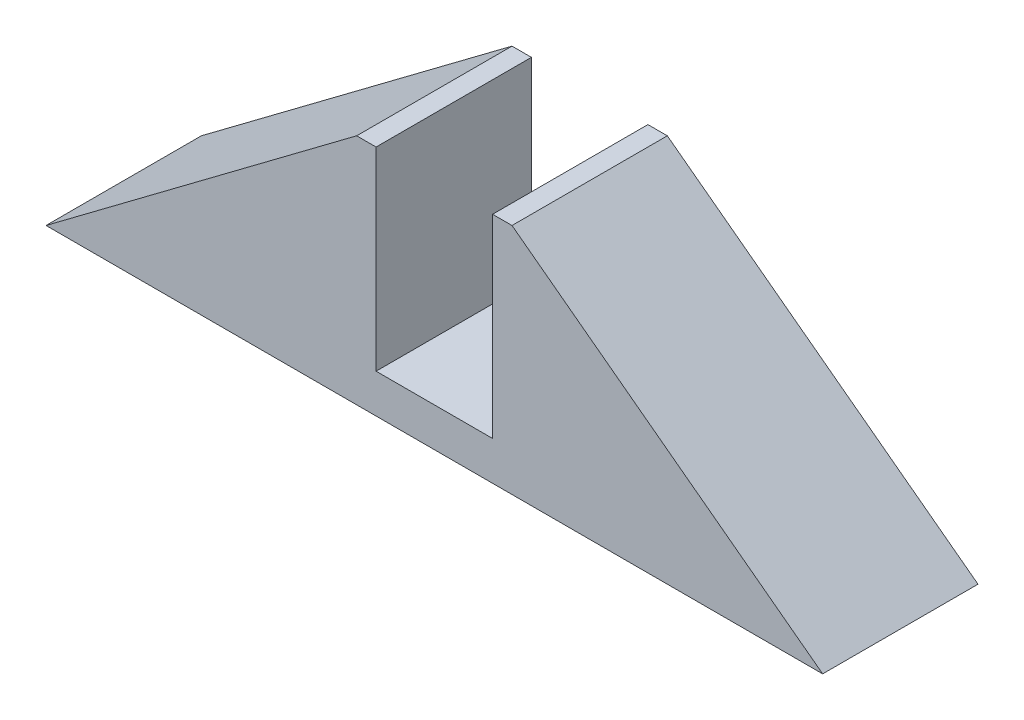
ISO-10303-21;
HEADER;
FILE_DESCRIPTION(('STEP AP214'),'2;1');
FILE_NAME('part.step','',(''),(''),'','','');
FILE_SCHEMA(('AUTOMOTIVE_DESIGN { 1 0 10303 214 1 1 1 1 }'));
ENDSEC;
DATA;
#1=APPLICATION_CONTEXT('core data for automotive mechanical design processes');
#2=APPLICATION_PROTOCOL_DEFINITION('international standard','automotive_design',2000,#1);
#3=PRODUCT_CONTEXT('',#1,'mechanical');
#4=PRODUCT('Part','Part','',(#3));
#5=PRODUCT_RELATED_PRODUCT_CATEGORY('part','',(#4));
#6=PRODUCT_DEFINITION_FORMATION('','',#4);
#7=PRODUCT_DEFINITION_CONTEXT('part definition',#1,'design');
#8=PRODUCT_DEFINITION('design','',#6,#7);
#9=PRODUCT_DEFINITION_SHAPE('','',#8);
#10=(LENGTH_UNIT() NAMED_UNIT(*) SI_UNIT(.MILLI.,.METRE.));
#11=(NAMED_UNIT(*) PLANE_ANGLE_UNIT() SI_UNIT($,.RADIAN.));
#12=(NAMED_UNIT(*) SI_UNIT($,.STERADIAN.) SOLID_ANGLE_UNIT());
#13=UNCERTAINTY_MEASURE_WITH_UNIT(LENGTH_MEASURE(1.E-05),#10,'distance_accuracy_value','');
#14=(GEOMETRIC_REPRESENTATION_CONTEXT(3) GLOBAL_UNCERTAINTY_ASSIGNED_CONTEXT((#13)) GLOBAL_UNIT_ASSIGNED_CONTEXT((#10,
#11,#12)) REPRESENTATION_CONTEXT('',''));
#15=CARTESIAN_POINT('',(0.,0.,0.));
#16=DIRECTION('',(0.,0.,1.));
#17=DIRECTION('',(1.,0.,0.));
#18=AXIS2_PLACEMENT_3D('',#15,#16,#17);
#19=CARTESIAN_POINT('',(-9.99999999999999,15.,10.));
#20=DIRECTION('',(0.,-1.,0.));
#21=DIRECTION('',(0.,0.,-1.));
#22=AXIS2_PLACEMENT_3D('',#19,#20,#21);
#23=PLANE('',#22);
#24=DIRECTION('',(-1.,0.,0.));
#25=VECTOR('',#24,1.);
#26=CARTESIAN_POINT('',(-9.99999999999999,15.,10.));
#27=LINE('',#26,#25);
#28=CARTESIAN_POINT('',(-7.5,15.,10.));
#29=VERTEX_POINT('',#28);
#30=CARTESIAN_POINT('',(-9.99999999999999,15.,10.));
#31=VERTEX_POINT('',#30);
#32=EDGE_CURVE('E163',#29,#31,#27,.T.);
#33=ORIENTED_EDGE('',*,*,#32,.F.);
#34=DIRECTION('',(0.,0.,1.));
#35=VECTOR('',#34,1.);
#36=CARTESIAN_POINT('',(-7.5,15.,-10.));
#37=LINE('',#36,#35);
#38=CARTESIAN_POINT('',(-7.5,15.,-10.));
#39=VERTEX_POINT('',#38);
#40=EDGE_CURVE('E149',#39,#29,#37,.T.);
#41=ORIENTED_EDGE('',*,*,#40,.F.);
#42=DIRECTION('',(-1.,0.,0.));
#43=VECTOR('',#42,1.);
#44=CARTESIAN_POINT('',(-9.99999999999999,15.,-10.));
#45=LINE('',#44,#43);
#46=CARTESIAN_POINT('',(-9.99999999999999,15.,-10.));
#47=VERTEX_POINT('',#46);
#48=EDGE_CURVE('E135',#39,#47,#45,.T.);
#49=ORIENTED_EDGE('',*,*,#48,.T.);
#50=DIRECTION('',(0.,0.,-1.));
#51=VECTOR('',#50,1.);
#52=CARTESIAN_POINT('',(-9.99999999999999,15.,10.));
#53=LINE('',#52,#51);
#54=EDGE_CURVE('E185',#31,#47,#53,.T.);
#55=ORIENTED_EDGE('',*,*,#54,.F.);
#56=EDGE_LOOP('',(#33,#41,#49,#55));
#57=FACE_BOUND('',#56,.T.);
#58=ADVANCED_FACE('F39',(#57),#23,.F.);
#59=CARTESIAN_POINT('',(9.99999999999999,15.,10.));
#60=DIRECTION('',(-0.6,-0.8,0.));
#61=DIRECTION('',(0.8,-0.6,0.));
#62=AXIS2_PLACEMENT_3D('',#59,#60,#61);
#63=PLANE('',#62);
#64=DIRECTION('',(-0.8,0.6,0.));
#65=VECTOR('',#64,1.);
#66=CARTESIAN_POINT('',(9.99999999999999,15.,-10.));
#67=LINE('',#66,#65);
#68=CARTESIAN_POINT('',(50.,-15.,-10.));
#69=VERTEX_POINT('',#68);
#70=CARTESIAN_POINT('',(9.99999999999999,15.,-10.));
#71=VERTEX_POINT('',#70);
#72=EDGE_CURVE('E152',#69,#71,#67,.T.);
#73=ORIENTED_EDGE('',*,*,#72,.T.);
#74=DIRECTION('',(0.,0.,-1.));
#75=VECTOR('',#74,1.);
#76=CARTESIAN_POINT('',(9.99999999999999,15.,10.));
#77=LINE('',#76,#75);
#78=CARTESIAN_POINT('',(9.99999999999999,15.,10.));
#79=VERTEX_POINT('',#78);
#80=EDGE_CURVE('E48',#79,#71,#77,.T.);
#81=ORIENTED_EDGE('',*,*,#80,.F.);
#82=DIRECTION('',(-0.8,0.6,0.));
#83=VECTOR('',#82,1.);
#84=CARTESIAN_POINT('',(9.99999999999999,15.,10.));
#85=LINE('',#84,#83);
#86=CARTESIAN_POINT('',(50.,-15.,10.));
#87=VERTEX_POINT('',#86);
#88=EDGE_CURVE('E93',#87,#79,#85,.T.);
#89=ORIENTED_EDGE('',*,*,#88,.F.);
#90=DIRECTION('',(0.,0.,-1.));
#91=VECTOR('',#90,1.);
#92=CARTESIAN_POINT('',(50.,-15.,10.));
#93=LINE('',#92,#91);
#94=EDGE_CURVE('E11',#87,#69,#93,.T.);
#95=ORIENTED_EDGE('',*,*,#94,.T.);
#96=EDGE_LOOP('',(#73,#81,#89,#95));
#97=FACE_BOUND('',#96,.T.);
#98=ADVANCED_FACE('F41',(#97),#63,.F.);
#99=CARTESIAN_POINT('',(7.5,15.,-10.));
#100=VERTEX_POINT('',#99);
#101=EDGE_CURVE('E174',#71,#100,#45,.T.);
#102=ORIENTED_EDGE('',*,*,#101,.T.);
#103=DIRECTION('',(0.,0.,1.));
#104=VECTOR('',#103,1.);
#105=CARTESIAN_POINT('',(7.5,15.,-10.));
#106=LINE('',#105,#104);
#107=CARTESIAN_POINT('',(7.5,15.,10.));
#108=VERTEX_POINT('',#107);
#109=EDGE_CURVE('E153',#100,#108,#106,.T.);
#110=ORIENTED_EDGE('',*,*,#109,.T.);
#111=EDGE_CURVE('E164',#79,#108,#27,.T.);
#112=ORIENTED_EDGE('',*,*,#111,.F.);
#113=ORIENTED_EDGE('',*,*,#80,.T.);
#114=EDGE_LOOP('',(#102,#110,#112,#113));
#115=FACE_BOUND('',#114,.T.);
#116=ADVANCED_FACE('F193',(#115),#23,.F.);
#117=CARTESIAN_POINT('',(-9.99999999999999,15.,10.));
#118=DIRECTION('',(0.6,-0.8,0.));
#119=DIRECTION('',(0.8,0.6,0.));
#120=AXIS2_PLACEMENT_3D('',#117,#118,#119);
#121=PLANE('',#120);
#122=DIRECTION('',(-0.8,-0.6,0.));
#123=VECTOR('',#122,1.);
#124=CARTESIAN_POINT('',(-9.99999999999999,15.,-10.));
#125=LINE('',#124,#123);
#126=CARTESIAN_POINT('',(-50.,-15.,-10.));
#127=VERTEX_POINT('',#126);
#128=EDGE_CURVE('E178',#47,#127,#125,.T.);
#129=ORIENTED_EDGE('',*,*,#128,.T.);
#130=DIRECTION('',(0.,0.,-1.));
#131=VECTOR('',#130,1.);
#132=CARTESIAN_POINT('',(-50.,-15.,10.));
#133=LINE('',#132,#131);
#134=CARTESIAN_POINT('',(-50.,-15.,10.));
#135=VERTEX_POINT('',#134);
#136=EDGE_CURVE('E171',#135,#127,#133,.T.);
#137=ORIENTED_EDGE('',*,*,#136,.F.);
#138=DIRECTION('',(-0.8,-0.6,0.));
#139=VECTOR('',#138,1.);
#140=CARTESIAN_POINT('',(-9.99999999999999,15.,10.));
#141=LINE('',#140,#139);
#142=EDGE_CURVE('E168',#31,#135,#141,.T.);
#143=ORIENTED_EDGE('',*,*,#142,.F.);
#144=ORIENTED_EDGE('',*,*,#54,.T.);
#145=EDGE_LOOP('',(#129,#137,#143,#144));
#146=FACE_BOUND('',#145,.T.);
#147=ADVANCED_FACE('F198',(#146),#121,.F.);
#148=CARTESIAN_POINT('',(-10.,-15.,10.));
#149=DIRECTION('',(0.,1.,0.));
#150=DIRECTION('',(0.,0.,1.));
#151=AXIS2_PLACEMENT_3D('',#148,#149,#150);
#152=PLANE('',#151);
#153=DIRECTION('',(1.,0.,0.));
#154=VECTOR('',#153,1.);
#155=CARTESIAN_POINT('',(-10.,-15.,-10.));
#156=LINE('',#155,#154);
#157=EDGE_CURVE('E86',#127,#69,#156,.T.);
#158=ORIENTED_EDGE('',*,*,#157,.T.);
#159=ORIENTED_EDGE('',*,*,#94,.F.);
#160=DIRECTION('',(1.,0.,0.));
#161=VECTOR('',#160,1.);
#162=CARTESIAN_POINT('',(50.,-15.,10.));
#163=LINE('',#162,#161);
#164=EDGE_CURVE('E64',#135,#87,#163,.T.);
#165=ORIENTED_EDGE('',*,*,#164,.F.);
#166=ORIENTED_EDGE('',*,*,#136,.T.);
#167=EDGE_LOOP('',(#158,#159,#165,#166));
#168=FACE_BOUND('',#167,.T.);
#169=ADVANCED_FACE('F194',(#168),#152,.F.);
#170=CARTESIAN_POINT('',(0.,0.,10.));
#171=DIRECTION('',(0.,0.,1.));
#172=DIRECTION('',(1.,0.,0.));
#173=AXIS2_PLACEMENT_3D('',#170,#171,#172);
#174=PLANE('',#173);
#175=DIRECTION('',(0.,-1.,0.));
#176=VECTOR('',#175,1.);
#177=CARTESIAN_POINT('',(-7.5,15.,10.));
#178=LINE('',#177,#176);
#179=CARTESIAN_POINT('',(-7.5,-10.,10.));
#180=VERTEX_POINT('',#179);
#181=EDGE_CURVE('E121',#29,#180,#178,.T.);
#182=ORIENTED_EDGE('',*,*,#181,.F.);
#183=ORIENTED_EDGE('',*,*,#32,.T.);
#184=ORIENTED_EDGE('',*,*,#142,.T.);
#185=ORIENTED_EDGE('',*,*,#164,.T.);
#186=ORIENTED_EDGE('',*,*,#88,.T.);
#187=ORIENTED_EDGE('',*,*,#111,.T.);
#188=DIRECTION('',(0.,1.,0.));
#189=VECTOR('',#188,1.);
#190=CARTESIAN_POINT('',(7.5,15.,10.));
#191=LINE('',#190,#189);
#192=CARTESIAN_POINT('',(7.5,-10.,10.));
#193=VERTEX_POINT('',#192);
#194=EDGE_CURVE('E137',#193,#108,#191,.T.);
#195=ORIENTED_EDGE('',*,*,#194,.F.);
#196=DIRECTION('',(1.,0.,0.));
#197=VECTOR('',#196,1.);
#198=CARTESIAN_POINT('',(-7.5,-10.,10.));
#199=LINE('',#198,#197);
#200=EDGE_CURVE('E140',#180,#193,#199,.T.);
#201=ORIENTED_EDGE('',*,*,#200,.F.);
#202=EDGE_LOOP('',(#182,#183,#184,#185,#186,#187,#195,#201));
#203=FACE_BOUND('',#202,.T.);
#204=ADVANCED_FACE('F205',(#203),#174,.T.);
#205=CARTESIAN_POINT('',(0.,0.,-10.));
#206=DIRECTION('',(0.,0.,1.));
#207=DIRECTION('',(1.,0.,0.));
#208=AXIS2_PLACEMENT_3D('',#205,#206,#207);
#209=PLANE('',#208);
#210=ORIENTED_EDGE('',*,*,#48,.F.);
#211=DIRECTION('',(0.,-1.,0.));
#212=VECTOR('',#211,1.);
#213=CARTESIAN_POINT('',(-7.5,15.,-10.));
#214=LINE('',#213,#212);
#215=CARTESIAN_POINT('',(-7.5,-10.,-10.));
#216=VERTEX_POINT('',#215);
#217=EDGE_CURVE('E118',#39,#216,#214,.T.);
#218=ORIENTED_EDGE('',*,*,#217,.T.);
#219=DIRECTION('',(1.,0.,0.));
#220=VECTOR('',#219,1.);
#221=CARTESIAN_POINT('',(-7.5,-10.,-10.));
#222=LINE('',#221,#220);
#223=CARTESIAN_POINT('',(7.5,-10.,-10.));
#224=VERTEX_POINT('',#223);
#225=EDGE_CURVE('E129',#216,#224,#222,.T.);
#226=ORIENTED_EDGE('',*,*,#225,.T.);
#227=DIRECTION('',(0.,1.,0.));
#228=VECTOR('',#227,1.);
#229=CARTESIAN_POINT('',(7.5,15.,-10.));
#230=LINE('',#229,#228);
#231=EDGE_CURVE('E55',#224,#100,#230,.T.);
#232=ORIENTED_EDGE('',*,*,#231,.T.);
#233=ORIENTED_EDGE('',*,*,#101,.F.);
#234=ORIENTED_EDGE('',*,*,#72,.F.);
#235=ORIENTED_EDGE('',*,*,#157,.F.);
#236=ORIENTED_EDGE('',*,*,#128,.F.);
#237=EDGE_LOOP('',(#210,#218,#226,#232,#233,#234,#235,#236));
#238=FACE_BOUND('',#237,.T.);
#239=ADVANCED_FACE('F134',(#238),#209,.F.);
#240=CARTESIAN_POINT('',(-7.5,15.,-10.));
#241=DIRECTION('',(-1.,0.,0.));
#242=DIRECTION('',(0.,-1.,0.));
#243=AXIS2_PLACEMENT_3D('',#240,#241,#242);
#244=PLANE('',#243);
#245=ORIENTED_EDGE('',*,*,#181,.T.);
#246=DIRECTION('',(0.,0.,1.));
#247=VECTOR('',#246,1.);
#248=CARTESIAN_POINT('',(-7.5,-10.,-10.));
#249=LINE('',#248,#247);
#250=EDGE_CURVE('E114',#216,#180,#249,.T.);
#251=ORIENTED_EDGE('',*,*,#250,.F.);
#252=ORIENTED_EDGE('',*,*,#217,.F.);
#253=ORIENTED_EDGE('',*,*,#40,.T.);
#254=EDGE_LOOP('',(#245,#251,#252,#253));
#255=FACE_BOUND('',#254,.T.);
#256=ADVANCED_FACE('F116',(#255),#244,.F.);
#257=CARTESIAN_POINT('',(7.5,15.,-10.));
#258=DIRECTION('',(1.,0.,0.));
#259=DIRECTION('',(0.,1.,0.));
#260=AXIS2_PLACEMENT_3D('',#257,#258,#259);
#261=PLANE('',#260);
#262=ORIENTED_EDGE('',*,*,#194,.T.);
#263=ORIENTED_EDGE('',*,*,#109,.F.);
#264=ORIENTED_EDGE('',*,*,#231,.F.);
#265=DIRECTION('',(0.,0.,1.));
#266=VECTOR('',#265,1.);
#267=CARTESIAN_POINT('',(7.5,-10.,-10.));
#268=LINE('',#267,#266);
#269=EDGE_CURVE('E126',#224,#193,#268,.T.);
#270=ORIENTED_EDGE('',*,*,#269,.T.);
#271=EDGE_LOOP('',(#262,#263,#264,#270));
#272=FACE_BOUND('',#271,.T.);
#273=ADVANCED_FACE('F207',(#272),#261,.F.);
#274=CARTESIAN_POINT('',(-7.5,-10.,-10.));
#275=DIRECTION('',(0.,-1.,0.));
#276=DIRECTION('',(1.,0.,0.));
#277=AXIS2_PLACEMENT_3D('',#274,#275,#276);
#278=PLANE('',#277);
#279=ORIENTED_EDGE('',*,*,#200,.T.);
#280=ORIENTED_EDGE('',*,*,#269,.F.);
#281=ORIENTED_EDGE('',*,*,#225,.F.);
#282=ORIENTED_EDGE('',*,*,#250,.T.);
#283=EDGE_LOOP('',(#279,#280,#281,#282));
#284=FACE_BOUND('',#283,.T.);
#285=ADVANCED_FACE('F130',(#284),#278,.F.);
#286=CLOSED_SHELL('',(#58,#98,#116,#147,#169,#204,#239,#256,#273,#285));
#287=MANIFOLD_SOLID_BREP('B2',#286);
#288=ADVANCED_BREP_SHAPE_REPRESENTATION('',(#18,#287),#14);
#289=SHAPE_DEFINITION_REPRESENTATION(#9,#288);
ENDSEC;
END-ISO-10303-21;
